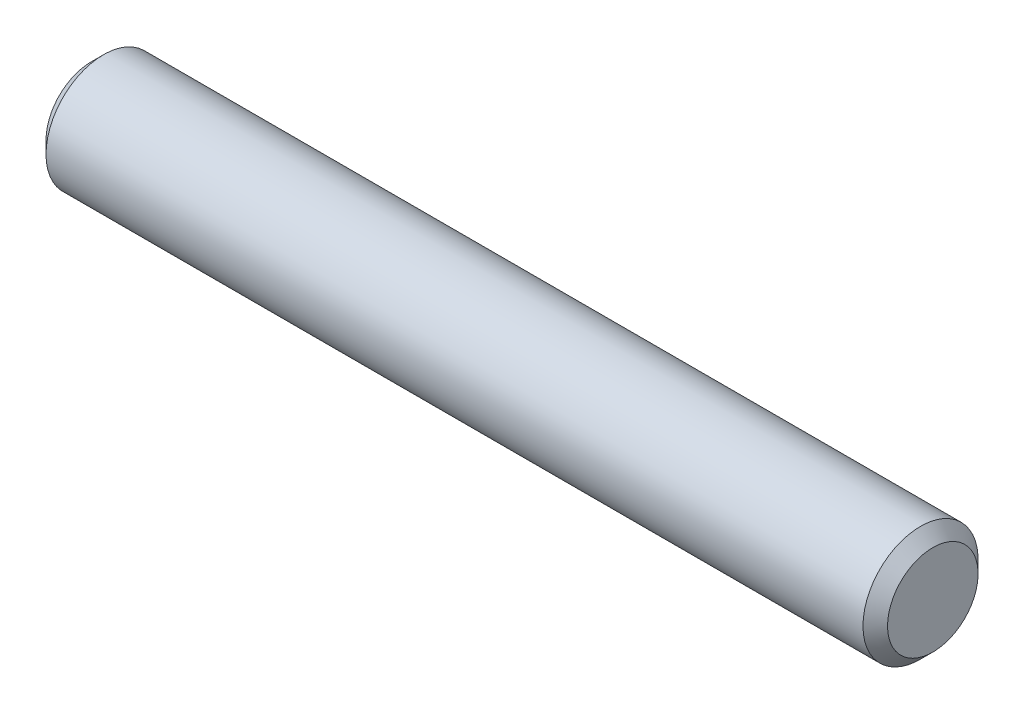
ISO-10303-21;
HEADER;
FILE_DESCRIPTION(('STEP AP214'),'2;1');
FILE_NAME('part.step','',(''),(''),'','','');
FILE_SCHEMA(('AUTOMOTIVE_DESIGN { 1 0 10303 214 1 1 1 1 }'));
ENDSEC;
DATA;
#1=APPLICATION_CONTEXT('core data for automotive mechanical design processes');
#2=APPLICATION_PROTOCOL_DEFINITION('international standard','automotive_design',2000,#1);
#3=PRODUCT_CONTEXT('',#1,'mechanical');
#4=PRODUCT('Part','Part','',(#3));
#5=PRODUCT_RELATED_PRODUCT_CATEGORY('part','',(#4));
#6=PRODUCT_DEFINITION_FORMATION('','',#4);
#7=PRODUCT_DEFINITION_CONTEXT('part definition',#1,'design');
#8=PRODUCT_DEFINITION('design','',#6,#7);
#9=PRODUCT_DEFINITION_SHAPE('','',#8);
#10=(LENGTH_UNIT() NAMED_UNIT(*) SI_UNIT(.MILLI.,.METRE.));
#11=(NAMED_UNIT(*) PLANE_ANGLE_UNIT() SI_UNIT($,.RADIAN.));
#12=(NAMED_UNIT(*) SI_UNIT($,.STERADIAN.) SOLID_ANGLE_UNIT());
#13=UNCERTAINTY_MEASURE_WITH_UNIT(LENGTH_MEASURE(1.E-05),#10,'distance_accuracy_value','');
#14=(GEOMETRIC_REPRESENTATION_CONTEXT(3) GLOBAL_UNCERTAINTY_ASSIGNED_CONTEXT((#13)) GLOBAL_UNIT_ASSIGNED_CONTEXT((#10,
#11,#12)) REPRESENTATION_CONTEXT('',''));
#15=CARTESIAN_POINT('',(0.,0.,0.));
#16=DIRECTION('',(0.,0.,1.));
#17=DIRECTION('',(1.,0.,0.));
#18=AXIS2_PLACEMENT_3D('',#15,#16,#17);
#19=CARTESIAN_POINT('',(9.49622325219224E-10,0.,0.));
#20=DIRECTION('',(1.,0.,0.));
#21=DIRECTION('',(0.,0.,-1.));
#22=AXIS2_PLACEMENT_3D('',#19,#20,#21);
#23=CONICAL_SURFACE('',#22,1.8719800002433,0.785398163397449);
#24=CARTESIAN_POINT('',(0.508000000608563,0.,0.));
#25=DIRECTION('',(-1.,0.,0.));
#26=DIRECTION('',(0.,0.,1.));
#27=AXIS2_PLACEMENT_3D('',#24,#25,#26);
#28=CIRCLE('',#27,2.37997999990224);
#29=CARTESIAN_POINT('',(0.508000000608563,0.,2.37997999990224));
#30=VERTEX_POINT('',#29);
#31=EDGE_CURVE('E10',#30,#30,#28,.T.);
#32=ORIENTED_EDGE('',*,*,#31,.T.);
#33=EDGE_LOOP('',(#32));
#34=FACE_BOUND('',#33,.T.);
#35=CARTESIAN_POINT('',(9.49622325219224E-10,0.,0.));
#36=DIRECTION('',(-1.,0.,0.));
#37=DIRECTION('',(0.,0.,1.));
#38=AXIS2_PLACEMENT_3D('',#35,#36,#37);
#39=CIRCLE('',#38,1.8719800002433);
#40=CARTESIAN_POINT('',(9.49622325219224E-10,0.,1.8719800002433));
#41=VERTEX_POINT('',#40);
#42=EDGE_CURVE('E28',#41,#41,#39,.T.);
#43=ORIENTED_EDGE('',*,*,#42,.F.);
#44=EDGE_LOOP('',(#43));
#45=FACE_BOUND('',#44,.T.);
#46=ADVANCED_FACE('F14',(#34,#45),#23,.T.);
#47=CARTESIAN_POINT('',(34.7980000002508,0.,0.));
#48=DIRECTION('',(-1.,0.,0.));
#49=DIRECTION('',(0.,0.,1.));
#50=AXIS2_PLACEMENT_3D('',#47,#48,#49);
#51=CYLINDRICAL_SURFACE('',#50,2.37997999990224);
#52=ORIENTED_EDGE('',*,*,#31,.F.);
#53=EDGE_LOOP('',(#52));
#54=FACE_BOUND('',#53,.T.);
#55=CARTESIAN_POINT('',(34.2900000006086,0.,0.));
#56=DIRECTION('',(-1.,0.,0.));
#57=DIRECTION('',(0.,0.,1.));
#58=AXIS2_PLACEMENT_3D('',#55,#56,#57);
#59=CIRCLE('',#58,2.37997999990224);
#60=CARTESIAN_POINT('',(34.2900000006086,0.,2.37997999990224));
#61=VERTEX_POINT('',#60);
#62=EDGE_CURVE('E22',#61,#61,#59,.T.);
#63=ORIENTED_EDGE('',*,*,#62,.T.);
#64=EDGE_LOOP('',(#63));
#65=FACE_BOUND('',#64,.T.);
#66=ADVANCED_FACE('F44',(#54,#65),#51,.T.);
#67=CARTESIAN_POINT('',(34.2900000006086,0.,0.));
#68=DIRECTION('',(-1.,0.,0.));
#69=DIRECTION('',(0.,0.,1.));
#70=AXIS2_PLACEMENT_3D('',#67,#68,#69);
#71=CONICAL_SURFACE('',#70,2.37997999990224,0.78539816339745);
#72=ORIENTED_EDGE('',*,*,#62,.F.);
#73=EDGE_LOOP('',(#72));
#74=FACE_BOUND('',#73,.T.);
#75=CARTESIAN_POINT('',(34.7980000002508,0.,0.));
#76=DIRECTION('',(-1.,0.,0.));
#77=DIRECTION('',(0.,0.,1.));
#78=AXIS2_PLACEMENT_3D('',#75,#76,#77);
#79=CIRCLE('',#78,1.87198000026001);
#80=CARTESIAN_POINT('',(34.7980000002508,0.,1.87198000026001));
#81=VERTEX_POINT('',#80);
#82=EDGE_CURVE('E18',#81,#81,#79,.T.);
#83=ORIENTED_EDGE('',*,*,#82,.T.);
#84=EDGE_LOOP('',(#83));
#85=FACE_BOUND('',#84,.T.);
#86=ADVANCED_FACE('F35',(#74,#85),#71,.T.);
#87=CARTESIAN_POINT('',(9.49621025427969E-10,0.,0.));
#88=DIRECTION('',(-1.,0.,0.));
#89=DIRECTION('',(0.,0.,1.));
#90=AXIS2_PLACEMENT_3D('',#87,#88,#89);
#91=PLANE('',#90);
#92=ORIENTED_EDGE('',*,*,#42,.T.);
#93=EDGE_LOOP('',(#92));
#94=FACE_BOUND('',#93,.T.);
#95=ADVANCED_FACE('F38',(#94),#91,.T.);
#96=CARTESIAN_POINT('',(34.7980000002508,1.87198000026001,0.));
#97=DIRECTION('',(1.,0.,0.));
#98=DIRECTION('',(0.,0.,-1.));
#99=AXIS2_PLACEMENT_3D('',#96,#97,#98);
#100=PLANE('',#99);
#101=ORIENTED_EDGE('',*,*,#82,.F.);
#102=EDGE_LOOP('',(#101));
#103=FACE_BOUND('',#102,.T.);
#104=ADVANCED_FACE('F16',(#103),#100,.T.);
#105=CLOSED_SHELL('',(#46,#66,#86,#95,#104));
#106=MANIFOLD_SOLID_BREP('B1',#105);
#107=ADVANCED_BREP_SHAPE_REPRESENTATION('',(#18,#106),#14);
#108=SHAPE_DEFINITION_REPRESENTATION(#9,#107);
ENDSEC;
END-ISO-10303-21;
